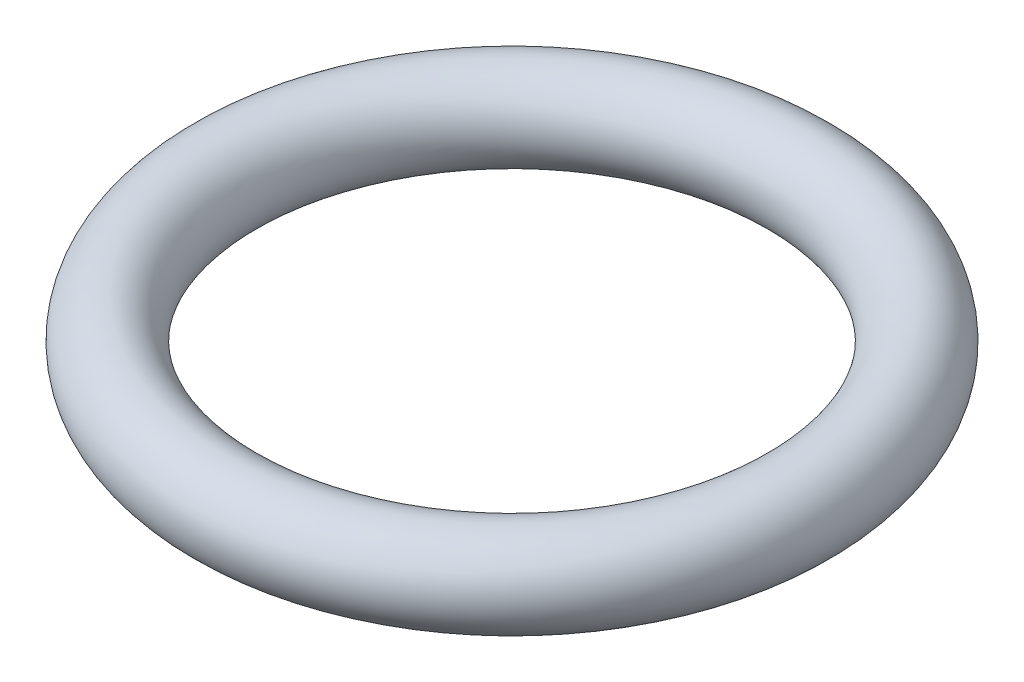
ISO-10303-21;
HEADER;
FILE_DESCRIPTION(('STEP AP214'),'2;1');
FILE_NAME('part.step','',(''),(''),'','','');
FILE_SCHEMA(('AUTOMOTIVE_DESIGN { 1 0 10303 214 1 1 1 1 }'));
ENDSEC;
DATA;
#1=APPLICATION_CONTEXT('core data for automotive mechanical design processes');
#2=APPLICATION_PROTOCOL_DEFINITION('international standard','automotive_design',2000,#1);
#3=PRODUCT_CONTEXT('',#1,'mechanical');
#4=PRODUCT('Part','Part','',(#3));
#5=PRODUCT_RELATED_PRODUCT_CATEGORY('part','',(#4));
#6=PRODUCT_DEFINITION_FORMATION('','',#4);
#7=PRODUCT_DEFINITION_CONTEXT('part definition',#1,'design');
#8=PRODUCT_DEFINITION('design','',#6,#7);
#9=PRODUCT_DEFINITION_SHAPE('','',#8);
#10=(LENGTH_UNIT() NAMED_UNIT(*) SI_UNIT(.MILLI.,.METRE.));
#11=(NAMED_UNIT(*) PLANE_ANGLE_UNIT() SI_UNIT($,.RADIAN.));
#12=(NAMED_UNIT(*) SI_UNIT($,.STERADIAN.) SOLID_ANGLE_UNIT());
#13=UNCERTAINTY_MEASURE_WITH_UNIT(LENGTH_MEASURE(1.E-05),#10,'distance_accuracy_value','');
#14=(GEOMETRIC_REPRESENTATION_CONTEXT(3) GLOBAL_UNCERTAINTY_ASSIGNED_CONTEXT((#13)) GLOBAL_UNIT_ASSIGNED_CONTEXT((#10,
#11,#12)) REPRESENTATION_CONTEXT('',''));
#15=CARTESIAN_POINT('',(0.,0.,0.));
#16=DIRECTION('',(0.,0.,1.));
#17=DIRECTION('',(1.,0.,0.));
#18=AXIS2_PLACEMENT_3D('',#15,#16,#17);
#19=CARTESIAN_POINT('',(0.,0.,0.));
#20=DIRECTION('',(0.,1.,0.));
#21=DIRECTION('',(0.,0.,1.));
#22=AXIS2_PLACEMENT_3D('',#19,#20,#21);
#23=TOROIDAL_SURFACE('',#22,8.25,1.25);
#24=CARTESIAN_POINT('',(0.,0.,9.5));
#25=VERTEX_POINT('',#24);
#26=VERTEX_LOOP('',#25);
#27=FACE_BOUND('',#26,.T.);
#28=ADVANCED_FACE('F29',(#27),#23,.T.);
#29=CLOSED_SHELL('',(#28));
#30=MANIFOLD_SOLID_BREP('B2',#29);
#31=ADVANCED_BREP_SHAPE_REPRESENTATION('',(#18,#30),#14);
#32=SHAPE_DEFINITION_REPRESENTATION(#9,#31);
ENDSEC;
END-ISO-10303-21;
